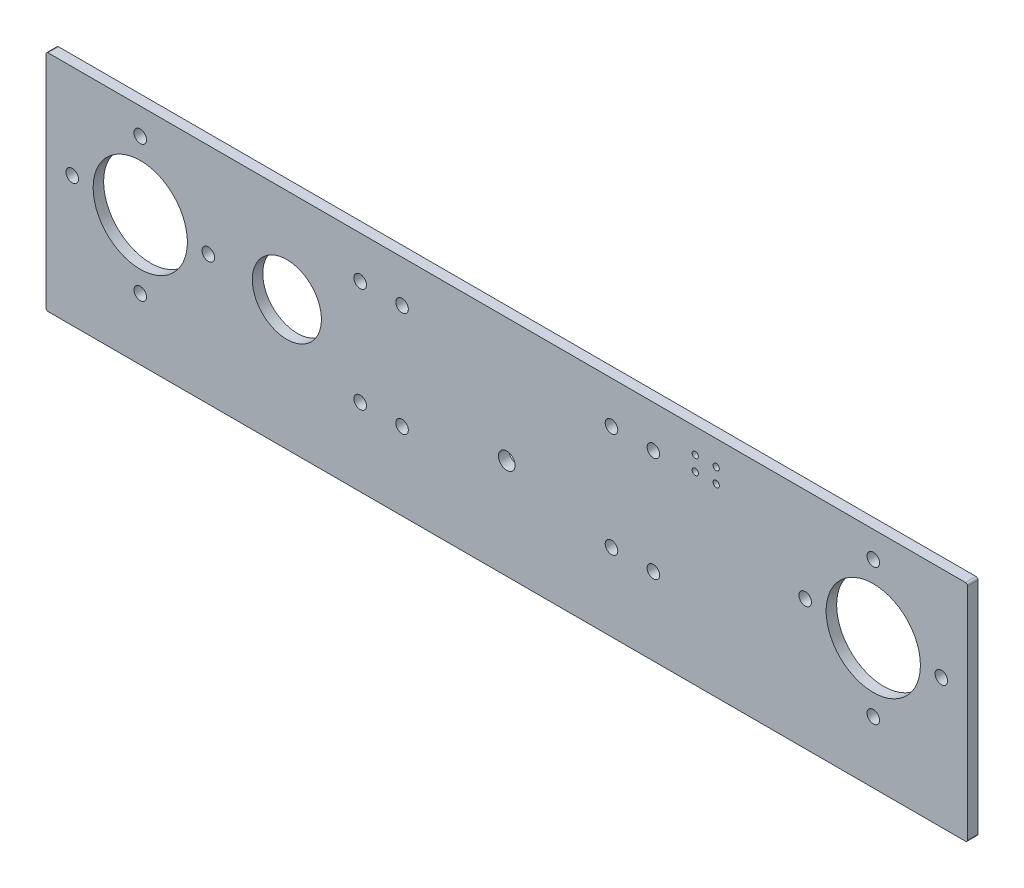
ISO-10303-21;
HEADER;
FILE_DESCRIPTION(('STEP AP214'),'2;1');
FILE_NAME('part.step','',(''),(''),'','','');
FILE_SCHEMA(('AUTOMOTIVE_DESIGN { 1 0 10303 214 1 1 1 1 }'));
ENDSEC;
DATA;
#1=APPLICATION_CONTEXT('core data for automotive mechanical design processes');
#2=APPLICATION_PROTOCOL_DEFINITION('international standard','automotive_design',2000,#1);
#3=PRODUCT_CONTEXT('',#1,'mechanical');
#4=PRODUCT('Part','Part','',(#3));
#5=PRODUCT_RELATED_PRODUCT_CATEGORY('part','',(#4));
#6=PRODUCT_DEFINITION_FORMATION('','',#4);
#7=PRODUCT_DEFINITION_CONTEXT('part definition',#1,'design');
#8=PRODUCT_DEFINITION('design','',#6,#7);
#9=PRODUCT_DEFINITION_SHAPE('','',#8);
#10=(LENGTH_UNIT() NAMED_UNIT(*) SI_UNIT(.MILLI.,.METRE.));
#11=(NAMED_UNIT(*) PLANE_ANGLE_UNIT() SI_UNIT($,.RADIAN.));
#12=(NAMED_UNIT(*) SI_UNIT($,.STERADIAN.) SOLID_ANGLE_UNIT());
#13=UNCERTAINTY_MEASURE_WITH_UNIT(LENGTH_MEASURE(1.E-05),#10,'distance_accuracy_value','');
#14=(GEOMETRIC_REPRESENTATION_CONTEXT(3) GLOBAL_UNCERTAINTY_ASSIGNED_CONTEXT((#13)) GLOBAL_UNIT_ASSIGNED_CONTEXT((#10,
#11,#12)) REPRESENTATION_CONTEXT('',''));
#15=CARTESIAN_POINT('',(0.,0.,0.));
#16=DIRECTION('',(0.,0.,1.));
#17=DIRECTION('',(1.,0.,0.));
#18=AXIS2_PLACEMENT_3D('',#15,#16,#17);
#19=CARTESIAN_POINT('',(220.,-53.5,-5.));
#20=DIRECTION('',(1.,0.,0.));
#21=DIRECTION('',(0.,0.,-1.));
#22=AXIS2_PLACEMENT_3D('',#19,#20,#21);
#23=PLANE('',#22);
#24=DIRECTION('',(0.,1.,0.));
#25=VECTOR('',#24,1.);
#26=CARTESIAN_POINT('',(220.,-53.5,0.));
#27=LINE('',#26,#25);
#28=CARTESIAN_POINT('',(220.,-52.5,0.));
#29=VERTEX_POINT('',#28);
#30=CARTESIAN_POINT('',(220.,52.5,0.));
#31=VERTEX_POINT('',#30);
#32=EDGE_CURVE('E277',#29,#31,#27,.T.);
#33=ORIENTED_EDGE('',*,*,#32,.F.);
#34=DIRECTION('',(0.,0.,1.));
#35=VECTOR('',#34,1.);
#36=CARTESIAN_POINT('',(220.,-52.5,-5.));
#37=LINE('',#36,#35);
#38=CARTESIAN_POINT('',(220.,-52.5,-5.));
#39=VERTEX_POINT('',#38);
#40=EDGE_CURVE('E11',#29,#39,#37,.F.);
#41=ORIENTED_EDGE('',*,*,#40,.T.);
#42=DIRECTION('',(0.,1.,0.));
#43=VECTOR('',#42,1.);
#44=CARTESIAN_POINT('',(220.,-53.5,-5.));
#45=LINE('',#44,#43);
#46=CARTESIAN_POINT('',(220.,52.5,-5.));
#47=VERTEX_POINT('',#46);
#48=EDGE_CURVE('E278',#39,#47,#45,.T.);
#49=ORIENTED_EDGE('',*,*,#48,.T.);
#50=DIRECTION('',(0.,0.,1.));
#51=VECTOR('',#50,1.);
#52=CARTESIAN_POINT('',(220.,52.5,-5.));
#53=LINE('',#52,#51);
#54=EDGE_CURVE('E49',#47,#31,#53,.T.);
#55=ORIENTED_EDGE('',*,*,#54,.T.);
#56=EDGE_LOOP('',(#33,#41,#49,#55));
#57=FACE_BOUND('',#56,.T.);
#58=ADVANCED_FACE('F40',(#57),#23,.T.);
#59=CARTESIAN_POINT('',(-220.,-53.5,-5.));
#60=DIRECTION('',(0.,-1.,0.));
#61=DIRECTION('',(0.,0.,-1.));
#62=AXIS2_PLACEMENT_3D('',#59,#60,#61);
#63=PLANE('',#62);
#64=DIRECTION('',(1.,0.,0.));
#65=VECTOR('',#64,1.);
#66=CARTESIAN_POINT('',(-220.,-53.5,0.));
#67=LINE('',#66,#65);
#68=CARTESIAN_POINT('',(-219.,-53.5,0.));
#69=VERTEX_POINT('',#68);
#70=CARTESIAN_POINT('',(219.,-53.5,0.));
#71=VERTEX_POINT('',#70);
#72=EDGE_CURVE('E127',#69,#71,#67,.T.);
#73=ORIENTED_EDGE('',*,*,#72,.F.);
#74=DIRECTION('',(0.,0.,1.));
#75=VECTOR('',#74,1.);
#76=CARTESIAN_POINT('',(-219.,-53.5,-5.));
#77=LINE('',#76,#75);
#78=CARTESIAN_POINT('',(-219.,-53.5,-5.));
#79=VERTEX_POINT('',#78);
#80=EDGE_CURVE('E147',#69,#79,#77,.F.);
#81=ORIENTED_EDGE('',*,*,#80,.T.);
#82=DIRECTION('',(1.,0.,0.));
#83=VECTOR('',#82,1.);
#84=CARTESIAN_POINT('',(-220.,-53.5,-5.));
#85=LINE('',#84,#83);
#86=CARTESIAN_POINT('',(219.,-53.5,-5.));
#87=VERTEX_POINT('',#86);
#88=EDGE_CURVE('E130',#79,#87,#85,.T.);
#89=ORIENTED_EDGE('',*,*,#88,.T.);
#90=DIRECTION('',(0.,0.,1.));
#91=VECTOR('',#90,1.);
#92=CARTESIAN_POINT('',(219.,-53.5,-5.));
#93=LINE('',#92,#91);
#94=EDGE_CURVE('E144',#87,#71,#93,.T.);
#95=ORIENTED_EDGE('',*,*,#94,.T.);
#96=EDGE_LOOP('',(#73,#81,#89,#95));
#97=FACE_BOUND('',#96,.T.);
#98=ADVANCED_FACE('F367',(#97),#63,.T.);
#99=CARTESIAN_POINT('',(-220.,-53.5,-5.));
#100=DIRECTION('',(-1.,0.,0.));
#101=DIRECTION('',(0.,0.,1.));
#102=AXIS2_PLACEMENT_3D('',#99,#100,#101);
#103=PLANE('',#102);
#104=DIRECTION('',(0.,-1.,0.));
#105=VECTOR('',#104,1.);
#106=CARTESIAN_POINT('',(-220.,-53.5,-5.));
#107=LINE('',#106,#105);
#108=CARTESIAN_POINT('',(-220.,52.5,-5.));
#109=VERTEX_POINT('',#108);
#110=CARTESIAN_POINT('',(-220.,-52.5,-5.));
#111=VERTEX_POINT('',#110);
#112=EDGE_CURVE('E135',#109,#111,#107,.T.);
#113=ORIENTED_EDGE('',*,*,#112,.T.);
#114=DIRECTION('',(0.,0.,1.));
#115=VECTOR('',#114,1.);
#116=CARTESIAN_POINT('',(-220.,-52.5,-5.));
#117=LINE('',#116,#115);
#118=CARTESIAN_POINT('',(-220.,-52.5,0.));
#119=VERTEX_POINT('',#118);
#120=EDGE_CURVE('E126',#111,#119,#117,.T.);
#121=ORIENTED_EDGE('',*,*,#120,.T.);
#122=DIRECTION('',(0.,-1.,0.));
#123=VECTOR('',#122,1.);
#124=CARTESIAN_POINT('',(-220.,-53.5,0.));
#125=LINE('',#124,#123);
#126=CARTESIAN_POINT('',(-220.,52.5,0.));
#127=VERTEX_POINT('',#126);
#128=EDGE_CURVE('E111',#127,#119,#125,.T.);
#129=ORIENTED_EDGE('',*,*,#128,.F.);
#130=DIRECTION('',(0.,0.,1.));
#131=VECTOR('',#130,1.);
#132=CARTESIAN_POINT('',(-220.,52.5,-5.));
#133=LINE('',#132,#131);
#134=EDGE_CURVE('E124',#127,#109,#133,.F.);
#135=ORIENTED_EDGE('',*,*,#134,.T.);
#136=EDGE_LOOP('',(#113,#121,#129,#135));
#137=FACE_BOUND('',#136,.T.);
#138=ADVANCED_FACE('F123',(#137),#103,.T.);
#139=CARTESIAN_POINT('',(-220.,53.5,-5.));
#140=DIRECTION('',(0.,1.,0.));
#141=DIRECTION('',(0.,0.,1.));
#142=AXIS2_PLACEMENT_3D('',#139,#140,#141);
#143=PLANE('',#142);
#144=DIRECTION('',(-1.,0.,0.));
#145=VECTOR('',#144,1.);
#146=CARTESIAN_POINT('',(-220.,53.5,-5.));
#147=LINE('',#146,#145);
#148=CARTESIAN_POINT('',(219.,53.5,-5.));
#149=VERTEX_POINT('',#148);
#150=CARTESIAN_POINT('',(-219.,53.5,-5.));
#151=VERTEX_POINT('',#150);
#152=EDGE_CURVE('E281',#149,#151,#147,.T.);
#153=ORIENTED_EDGE('',*,*,#152,.T.);
#154=DIRECTION('',(0.,0.,1.));
#155=VECTOR('',#154,1.);
#156=CARTESIAN_POINT('',(-219.,53.5,-5.));
#157=LINE('',#156,#155);
#158=CARTESIAN_POINT('',(-219.,53.5,0.));
#159=VERTEX_POINT('',#158);
#160=EDGE_CURVE('E157',#151,#159,#157,.T.);
#161=ORIENTED_EDGE('',*,*,#160,.T.);
#162=DIRECTION('',(-1.,0.,0.));
#163=VECTOR('',#162,1.);
#164=CARTESIAN_POINT('',(-220.,53.5,0.));
#165=LINE('',#164,#163);
#166=CARTESIAN_POINT('',(219.,53.5,0.));
#167=VERTEX_POINT('',#166);
#168=EDGE_CURVE('E112',#167,#159,#165,.T.);
#169=ORIENTED_EDGE('',*,*,#168,.F.);
#170=DIRECTION('',(0.,0.,1.));
#171=VECTOR('',#170,1.);
#172=CARTESIAN_POINT('',(219.,53.5,-5.));
#173=LINE('',#172,#171);
#174=EDGE_CURVE('E64',#167,#149,#173,.F.);
#175=ORIENTED_EDGE('',*,*,#174,.T.);
#176=EDGE_LOOP('',(#153,#161,#169,#175));
#177=FACE_BOUND('',#176,.T.);
#178=ADVANCED_FACE('F379',(#177),#143,.T.);
#179=CARTESIAN_POINT('',(0.,0.,-5.));
#180=DIRECTION('',(0.,0.,-1.));
#181=DIRECTION('',(-1.,0.,0.));
#182=AXIS2_PLACEMENT_3D('',#179,#180,#181);
#183=PLANE('',#182);
#184=CARTESIAN_POINT('',(100.,34.75,-5.));
#185=DIRECTION('',(0.,0.,-1.));
#186=DIRECTION('',(-1.,0.,0.));
#187=AXIS2_PLACEMENT_3D('',#184,#185,#186);
#188=CIRCLE('',#187,1.50000000000001);
#189=CARTESIAN_POINT('',(98.5,34.75,-5.));
#190=VERTEX_POINT('',#189);
#191=EDGE_CURVE('E752',#190,#190,#188,.T.);
#192=ORIENTED_EDGE('',*,*,#191,.F.);
#193=EDGE_LOOP('',(#192));
#194=FACE_BOUND('',#193,.T.);
#195=CARTESIAN_POINT('',(90.0000000000001,34.75,-5.));
#196=DIRECTION('',(0.,0.,-1.));
#197=DIRECTION('',(-1.,0.,0.));
#198=AXIS2_PLACEMENT_3D('',#195,#196,#197);
#199=CIRCLE('',#198,1.5);
#200=CARTESIAN_POINT('',(88.5000000000001,34.75,-5.));
#201=VERTEX_POINT('',#200);
#202=EDGE_CURVE('E753',#201,#201,#199,.T.);
#203=ORIENTED_EDGE('',*,*,#202,.F.);
#204=EDGE_LOOP('',(#203));
#205=FACE_BOUND('',#204,.T.);
#206=CARTESIAN_POINT('',(90.0000000000001,41.75,-5.));
#207=DIRECTION('',(0.,0.,-1.));
#208=DIRECTION('',(-1.,0.,0.));
#209=AXIS2_PLACEMENT_3D('',#206,#207,#208);
#210=CIRCLE('',#209,1.5);
#211=CARTESIAN_POINT('',(88.5000000000001,41.75,-5.));
#212=VERTEX_POINT('',#211);
#213=EDGE_CURVE('E756',#212,#212,#210,.T.);
#214=ORIENTED_EDGE('',*,*,#213,.F.);
#215=EDGE_LOOP('',(#214));
#216=FACE_BOUND('',#215,.T.);
#217=CARTESIAN_POINT('',(100.,41.75,-5.));
#218=DIRECTION('',(0.,0.,-1.));
#219=DIRECTION('',(-1.,0.,0.));
#220=AXIS2_PLACEMENT_3D('',#217,#218,#219);
#221=CIRCLE('',#220,1.50000000000001);
#222=CARTESIAN_POINT('',(98.5,41.75,-5.));
#223=VERTEX_POINT('',#222);
#224=EDGE_CURVE('E165',#223,#223,#221,.T.);
#225=ORIENTED_EDGE('',*,*,#224,.F.);
#226=EDGE_LOOP('',(#225));
#227=FACE_BOUND('',#226,.T.);
#228=CARTESIAN_POINT('',(70.,-16.5,-5.));
#229=DIRECTION('',(0.,0.,1.));
#230=DIRECTION('',(-1.,0.,0.));
#231=AXIS2_PLACEMENT_3D('',#228,#229,#230);
#232=CIRCLE('',#231,3.00000000000001);
#233=CARTESIAN_POINT('',(67.,-16.5,-5.));
#234=VERTEX_POINT('',#233);
#235=EDGE_CURVE('E176',#234,#234,#232,.T.);
#236=ORIENTED_EDGE('',*,*,#235,.T.);
#237=EDGE_LOOP('',(#236));
#238=FACE_BOUND('',#237,.T.);
#239=CARTESIAN_POINT('',(50.,-16.5,-5.));
#240=DIRECTION('',(0.,0.,1.));
#241=DIRECTION('',(-1.,0.,0.));
#242=AXIS2_PLACEMENT_3D('',#239,#240,#241);
#243=CIRCLE('',#242,3.00000000000001);
#244=CARTESIAN_POINT('',(47.,-16.5,-5.));
#245=VERTEX_POINT('',#244);
#246=EDGE_CURVE('E172',#245,#245,#243,.T.);
#247=ORIENTED_EDGE('',*,*,#246,.T.);
#248=EDGE_LOOP('',(#247));
#249=FACE_BOUND('',#248,.T.);
#250=CARTESIAN_POINT('',(-70.,-16.5,-5.));
#251=DIRECTION('',(0.,0.,-1.));
#252=DIRECTION('',(1.,0.,0.));
#253=AXIS2_PLACEMENT_3D('',#250,#251,#252);
#254=CIRCLE('',#253,3.00000000000001);
#255=CARTESIAN_POINT('',(-67.,-16.5,-5.));
#256=VERTEX_POINT('',#255);
#257=EDGE_CURVE('E185',#256,#256,#254,.T.);
#258=ORIENTED_EDGE('',*,*,#257,.F.);
#259=EDGE_LOOP('',(#258));
#260=FACE_BOUND('',#259,.T.);
#261=CARTESIAN_POINT('',(-50.,-16.5,-5.));
#262=DIRECTION('',(0.,0.,-1.));
#263=DIRECTION('',(1.,0.,0.));
#264=AXIS2_PLACEMENT_3D('',#261,#262,#263);
#265=CIRCLE('',#264,3.00000000000001);
#266=CARTESIAN_POINT('',(-47.,-16.5,-5.));
#267=VERTEX_POINT('',#266);
#268=EDGE_CURVE('E189',#267,#267,#265,.T.);
#269=ORIENTED_EDGE('',*,*,#268,.F.);
#270=EDGE_LOOP('',(#269));
#271=FACE_BOUND('',#270,.T.);
#272=CARTESIAN_POINT('',(-70.,33.5,-5.));
#273=DIRECTION('',(0.,0.,1.));
#274=DIRECTION('',(1.,0.,0.));
#275=AXIS2_PLACEMENT_3D('',#272,#273,#274);
#276=CIRCLE('',#275,3.00000000000001);
#277=CARTESIAN_POINT('',(-67.,33.5,-5.));
#278=VERTEX_POINT('',#277);
#279=EDGE_CURVE('E192',#278,#278,#276,.T.);
#280=ORIENTED_EDGE('',*,*,#279,.T.);
#281=EDGE_LOOP('',(#280));
#282=FACE_BOUND('',#281,.T.);
#283=CARTESIAN_POINT('',(-50.,33.5,-5.));
#284=DIRECTION('',(0.,0.,1.));
#285=DIRECTION('',(1.,0.,0.));
#286=AXIS2_PLACEMENT_3D('',#283,#284,#285);
#287=CIRCLE('',#286,3.00000000000001);
#288=CARTESIAN_POINT('',(-47.,33.5,-5.));
#289=VERTEX_POINT('',#288);
#290=EDGE_CURVE('E196',#289,#289,#287,.T.);
#291=ORIENTED_EDGE('',*,*,#290,.T.);
#292=EDGE_LOOP('',(#291));
#293=FACE_BOUND('',#292,.T.);
#294=CARTESIAN_POINT('',(70.,33.5,-5.));
#295=DIRECTION('',(0.,0.,-1.));
#296=DIRECTION('',(-1.,0.,0.));
#297=AXIS2_PLACEMENT_3D('',#294,#295,#296);
#298=CIRCLE('',#297,3.00000000000001);
#299=CARTESIAN_POINT('',(67.,33.5,-5.));
#300=VERTEX_POINT('',#299);
#301=EDGE_CURVE('E200',#300,#300,#298,.T.);
#302=ORIENTED_EDGE('',*,*,#301,.F.);
#303=EDGE_LOOP('',(#302));
#304=FACE_BOUND('',#303,.T.);
#305=CARTESIAN_POINT('',(50.,33.5,-5.));
#306=DIRECTION('',(0.,0.,-1.));
#307=DIRECTION('',(-1.,0.,0.));
#308=AXIS2_PLACEMENT_3D('',#305,#306,#307);
#309=CIRCLE('',#308,3.00000000000001);
#310=CARTESIAN_POINT('',(47.,33.5,-5.));
#311=VERTEX_POINT('',#310);
#312=EDGE_CURVE('E204',#311,#311,#309,.T.);
#313=ORIENTED_EDGE('',*,*,#312,.F.);
#314=EDGE_LOOP('',(#313));
#315=FACE_BOUND('',#314,.T.);
#316=CARTESIAN_POINT('',(0.,-5.63050654164931,-5.));
#317=DIRECTION('',(0.,0.,-1.));
#318=DIRECTION('',(-1.,0.,0.));
#319=AXIS2_PLACEMENT_3D('',#316,#317,#318);
#320=CIRCLE('',#319,4.);
#321=CARTESIAN_POINT('',(-4.,-5.63050654164931,-5.));
#322=VERTEX_POINT('',#321);
#323=EDGE_CURVE('E208',#322,#322,#320,.T.);
#324=ORIENTED_EDGE('',*,*,#323,.F.);
#325=EDGE_LOOP('',(#324));
#326=FACE_BOUND('',#325,.T.);
#327=CARTESIAN_POINT('',(-105.,8.50000000000001,-5.));
#328=DIRECTION('',(0.,0.,-1.));
#329=DIRECTION('',(-1.,0.,0.));
#330=AXIS2_PLACEMENT_3D('',#327,#328,#329);
#331=CIRCLE('',#330,16.5);
#332=CARTESIAN_POINT('',(-121.5,8.50000000000001,-5.));
#333=VERTEX_POINT('',#332);
#334=EDGE_CURVE('E213',#333,#333,#331,.T.);
#335=ORIENTED_EDGE('',*,*,#334,.F.);
#336=EDGE_LOOP('',(#335));
#337=FACE_BOUND('',#336,.T.);
#338=CARTESIAN_POINT('',(-175.,41.,-5.));
#339=DIRECTION('',(0.,0.,-1.));
#340=DIRECTION('',(-1.,0.,0.));
#341=AXIS2_PLACEMENT_3D('',#338,#339,#340);
#342=CIRCLE('',#341,2.99999999999999);
#343=CARTESIAN_POINT('',(-178.,41.,-5.));
#344=VERTEX_POINT('',#343);
#345=EDGE_CURVE('E238',#344,#344,#342,.F.);
#346=ORIENTED_EDGE('',*,*,#345,.T.);
#347=EDGE_LOOP('',(#346));
#348=FACE_BOUND('',#347,.T.);
#349=CARTESIAN_POINT('',(-207.5,8.5,-5.));
#350=DIRECTION('',(0.,0.,-1.));
#351=DIRECTION('',(-1.,0.,0.));
#352=AXIS2_PLACEMENT_3D('',#349,#350,#351);
#353=CIRCLE('',#352,2.99999999999997);
#354=CARTESIAN_POINT('',(-210.5,8.5,-5.));
#355=VERTEX_POINT('',#354);
#356=EDGE_CURVE('E235',#355,#355,#353,.F.);
#357=ORIENTED_EDGE('',*,*,#356,.T.);
#358=EDGE_LOOP('',(#357));
#359=FACE_BOUND('',#358,.T.);
#360=CARTESIAN_POINT('',(-175.,-24.,-5.));
#361=DIRECTION('',(0.,0.,-1.));
#362=DIRECTION('',(-1.,0.,0.));
#363=AXIS2_PLACEMENT_3D('',#360,#361,#362);
#364=CIRCLE('',#363,2.99999999999999);
#365=CARTESIAN_POINT('',(-178.,-24.,-5.));
#366=VERTEX_POINT('',#365);
#367=EDGE_CURVE('E232',#366,#366,#364,.F.);
#368=ORIENTED_EDGE('',*,*,#367,.T.);
#369=EDGE_LOOP('',(#368));
#370=FACE_BOUND('',#369,.T.);
#371=CARTESIAN_POINT('',(-142.5,8.50000000000001,-5.));
#372=DIRECTION('',(0.,0.,-1.));
#373=DIRECTION('',(-1.,0.,0.));
#374=AXIS2_PLACEMENT_3D('',#371,#372,#373);
#375=CIRCLE('',#374,2.99999999999999);
#376=CARTESIAN_POINT('',(-145.5,8.50000000000001,-5.));
#377=VERTEX_POINT('',#376);
#378=EDGE_CURVE('E220',#377,#377,#375,.F.);
#379=ORIENTED_EDGE('',*,*,#378,.T.);
#380=EDGE_LOOP('',(#379));
#381=FACE_BOUND('',#380,.T.);
#382=CARTESIAN_POINT('',(-175.,8.50000000000001,-5.));
#383=DIRECTION('',(0.,0.,-1.));
#384=DIRECTION('',(-1.,0.,0.));
#385=AXIS2_PLACEMENT_3D('',#382,#383,#384);
#386=CIRCLE('',#385,22.5);
#387=CARTESIAN_POINT('',(-197.5,8.50000000000001,-5.));
#388=VERTEX_POINT('',#387);
#389=EDGE_CURVE('E244',#388,#388,#386,.F.);
#390=ORIENTED_EDGE('',*,*,#389,.T.);
#391=EDGE_LOOP('',(#390));
#392=FACE_BOUND('',#391,.T.);
#393=CARTESIAN_POINT('',(175.,41.,-5.));
#394=DIRECTION('',(0.,0.,-1.));
#395=DIRECTION('',(-1.,0.,0.));
#396=AXIS2_PLACEMENT_3D('',#393,#394,#395);
#397=CIRCLE('',#396,2.99999999999999);
#398=CARTESIAN_POINT('',(172.,41.,-5.));
#399=VERTEX_POINT('',#398);
#400=EDGE_CURVE('E268',#399,#399,#397,.T.);
#401=ORIENTED_EDGE('',*,*,#400,.F.);
#402=EDGE_LOOP('',(#401));
#403=FACE_BOUND('',#402,.T.);
#404=CARTESIAN_POINT('',(207.5,8.5,-5.));
#405=DIRECTION('',(0.,0.,-1.));
#406=DIRECTION('',(-1.,0.,0.));
#407=AXIS2_PLACEMENT_3D('',#404,#405,#406);
#408=CIRCLE('',#407,2.99999999999997);
#409=CARTESIAN_POINT('',(204.5,8.5,-5.));
#410=VERTEX_POINT('',#409);
#411=EDGE_CURVE('E265',#410,#410,#408,.T.);
#412=ORIENTED_EDGE('',*,*,#411,.F.);
#413=EDGE_LOOP('',(#412));
#414=FACE_BOUND('',#413,.T.);
#415=CARTESIAN_POINT('',(175.,-24.,-5.));
#416=DIRECTION('',(0.,0.,-1.));
#417=DIRECTION('',(-1.,0.,0.));
#418=AXIS2_PLACEMENT_3D('',#415,#416,#417);
#419=CIRCLE('',#418,2.99999999999999);
#420=CARTESIAN_POINT('',(172.,-24.,-5.));
#421=VERTEX_POINT('',#420);
#422=EDGE_CURVE('E262',#421,#421,#419,.T.);
#423=ORIENTED_EDGE('',*,*,#422,.F.);
#424=EDGE_LOOP('',(#423));
#425=FACE_BOUND('',#424,.T.);
#426=CARTESIAN_POINT('',(142.5,8.50000000000001,-5.));
#427=DIRECTION('',(0.,0.,-1.));
#428=DIRECTION('',(-1.,0.,0.));
#429=AXIS2_PLACEMENT_3D('',#426,#427,#428);
#430=CIRCLE('',#429,2.99999999999999);
#431=CARTESIAN_POINT('',(139.5,8.50000000000001,-5.));
#432=VERTEX_POINT('',#431);
#433=EDGE_CURVE('E251',#432,#432,#430,.T.);
#434=ORIENTED_EDGE('',*,*,#433,.F.);
#435=EDGE_LOOP('',(#434));
#436=FACE_BOUND('',#435,.T.);
#437=CARTESIAN_POINT('',(175.,8.50000000000001,-5.));
#438=DIRECTION('',(0.,0.,-1.));
#439=DIRECTION('',(-1.,0.,0.));
#440=AXIS2_PLACEMENT_3D('',#437,#438,#439);
#441=CIRCLE('',#440,22.5);
#442=CARTESIAN_POINT('',(152.5,8.50000000000001,-5.));
#443=VERTEX_POINT('',#442);
#444=EDGE_CURVE('E274',#443,#443,#441,.T.);
#445=ORIENTED_EDGE('',*,*,#444,.F.);
#446=EDGE_LOOP('',(#445));
#447=FACE_BOUND('',#446,.T.);
#448=ORIENTED_EDGE('',*,*,#88,.F.);
#449=CARTESIAN_POINT('',(-219.,-52.5,-5.));
#450=DIRECTION('',(0.,0.,-1.));
#451=DIRECTION('',(-1.,0.,0.));
#452=AXIS2_PLACEMENT_3D('',#449,#450,#451);
#453=CIRCLE('',#452,1.);
#454=EDGE_CURVE('E154',#79,#111,#453,.T.);
#455=ORIENTED_EDGE('',*,*,#454,.T.);
#456=ORIENTED_EDGE('',*,*,#112,.F.);
#457=CARTESIAN_POINT('',(-219.,52.5,-5.));
#458=DIRECTION('',(0.,0.,-1.));
#459=DIRECTION('',(-1.,0.,0.));
#460=AXIS2_PLACEMENT_3D('',#457,#458,#459);
#461=CIRCLE('',#460,1.);
#462=EDGE_CURVE('E57',#109,#151,#461,.T.);
#463=ORIENTED_EDGE('',*,*,#462,.T.);
#464=ORIENTED_EDGE('',*,*,#152,.F.);
#465=CARTESIAN_POINT('',(219.,52.5,-5.));
#466=DIRECTION('',(0.,0.,-1.));
#467=DIRECTION('',(-1.,0.,0.));
#468=AXIS2_PLACEMENT_3D('',#465,#466,#467);
#469=CIRCLE('',#468,1.);
#470=EDGE_CURVE('E149',#149,#47,#469,.T.);
#471=ORIENTED_EDGE('',*,*,#470,.T.);
#472=ORIENTED_EDGE('',*,*,#48,.F.);
#473=CARTESIAN_POINT('',(219.,-52.5,-5.));
#474=DIRECTION('',(0.,0.,-1.));
#475=DIRECTION('',(-1.,0.,0.));
#476=AXIS2_PLACEMENT_3D('',#473,#474,#475);
#477=CIRCLE('',#476,1.);
#478=EDGE_CURVE('E151',#39,#87,#477,.T.);
#479=ORIENTED_EDGE('',*,*,#478,.T.);
#480=EDGE_LOOP('',(#448,#455,#456,#463,#464,#471,#472,#479));
#481=FACE_BOUND('',#480,.T.);
#482=ADVANCED_FACE('F315',(#194,#205,#216,#227,#238,#249,#260,#271,#282,#293,#304,#315,#326,
#337,#348,#359,#370,#381,#392,#403,#414,#425,#436,#447,#481),#183,.T.);
#483=CARTESIAN_POINT('',(0.,0.,0.));
#484=DIRECTION('',(0.,0.,-1.));
#485=DIRECTION('',(-1.,0.,0.));
#486=AXIS2_PLACEMENT_3D('',#483,#484,#485);
#487=PLANE('',#486);
#488=CARTESIAN_POINT('',(100.,34.75,0.));
#489=DIRECTION('',(0.,0.,-1.));
#490=DIRECTION('',(-1.,0.,0.));
#491=AXIS2_PLACEMENT_3D('',#488,#489,#490);
#492=CIRCLE('',#491,1.50000000000001);
#493=CARTESIAN_POINT('',(98.5,34.75,0.));
#494=VERTEX_POINT('',#493);
#495=EDGE_CURVE('E44',#494,#494,#492,.T.);
#496=ORIENTED_EDGE('',*,*,#495,.T.);
#497=EDGE_LOOP('',(#496));
#498=FACE_BOUND('',#497,.T.);
#499=CARTESIAN_POINT('',(90.0000000000001,34.75,0.));
#500=DIRECTION('',(0.,0.,-1.));
#501=DIRECTION('',(-1.,0.,0.));
#502=AXIS2_PLACEMENT_3D('',#499,#500,#501);
#503=CIRCLE('',#502,1.5);
#504=CARTESIAN_POINT('',(88.5000000000001,34.75,0.));
#505=VERTEX_POINT('',#504);
#506=EDGE_CURVE('E167',#505,#505,#503,.T.);
#507=ORIENTED_EDGE('',*,*,#506,.T.);
#508=EDGE_LOOP('',(#507));
#509=FACE_BOUND('',#508,.T.);
#510=CARTESIAN_POINT('',(90.0000000000001,41.75,0.));
#511=DIRECTION('',(0.,0.,-1.));
#512=DIRECTION('',(-1.,0.,0.));
#513=AXIS2_PLACEMENT_3D('',#510,#511,#512);
#514=CIRCLE('',#513,1.5);
#515=CARTESIAN_POINT('',(88.5000000000001,41.75,0.));
#516=VERTEX_POINT('',#515);
#517=EDGE_CURVE('E164',#516,#516,#514,.T.);
#518=ORIENTED_EDGE('',*,*,#517,.T.);
#519=EDGE_LOOP('',(#518));
#520=FACE_BOUND('',#519,.T.);
#521=CARTESIAN_POINT('',(100.,41.75,0.));
#522=DIRECTION('',(0.,0.,-1.));
#523=DIRECTION('',(-1.,0.,0.));
#524=AXIS2_PLACEMENT_3D('',#521,#522,#523);
#525=CIRCLE('',#524,1.50000000000001);
#526=CARTESIAN_POINT('',(98.5,41.75,0.));
#527=VERTEX_POINT('',#526);
#528=EDGE_CURVE('E161',#527,#527,#525,.T.);
#529=ORIENTED_EDGE('',*,*,#528,.T.);
#530=EDGE_LOOP('',(#529));
#531=FACE_BOUND('',#530,.T.);
#532=CARTESIAN_POINT('',(70.,-16.5,0.));
#533=DIRECTION('',(0.,0.,-1.));
#534=DIRECTION('',(-1.,0.,0.));
#535=AXIS2_PLACEMENT_3D('',#532,#533,#534);
#536=CIRCLE('',#535,3.00000000000001);
#537=CARTESIAN_POINT('',(67.,-16.5,0.));
#538=VERTEX_POINT('',#537);
#539=EDGE_CURVE('E138',#538,#538,#536,.F.);
#540=ORIENTED_EDGE('',*,*,#539,.F.);
#541=EDGE_LOOP('',(#540));
#542=FACE_BOUND('',#541,.T.);
#543=CARTESIAN_POINT('',(50.,-16.5,0.));
#544=DIRECTION('',(0.,0.,-1.));
#545=DIRECTION('',(-1.,0.,0.));
#546=AXIS2_PLACEMENT_3D('',#543,#544,#545);
#547=CIRCLE('',#546,3.00000000000001);
#548=CARTESIAN_POINT('',(47.,-16.5,0.));
#549=VERTEX_POINT('',#548);
#550=EDGE_CURVE('E181',#549,#549,#547,.F.);
#551=ORIENTED_EDGE('',*,*,#550,.F.);
#552=EDGE_LOOP('',(#551));
#553=FACE_BOUND('',#552,.T.);
#554=CARTESIAN_POINT('',(-70.,-16.5,0.));
#555=DIRECTION('',(0.,0.,-1.));
#556=DIRECTION('',(-1.,0.,0.));
#557=AXIS2_PLACEMENT_3D('',#554,#555,#556);
#558=CIRCLE('',#557,3.00000000000001);
#559=CARTESIAN_POINT('',(-73.,-16.5,0.));
#560=VERTEX_POINT('',#559);
#561=EDGE_CURVE('E199',#560,#560,#558,.T.);
#562=ORIENTED_EDGE('',*,*,#561,.T.);
#563=EDGE_LOOP('',(#562));
#564=FACE_BOUND('',#563,.T.);
#565=CARTESIAN_POINT('',(-50.,-16.5,0.));
#566=DIRECTION('',(0.,0.,-1.));
#567=DIRECTION('',(-1.,0.,0.));
#568=AXIS2_PLACEMENT_3D('',#565,#566,#567);
#569=CIRCLE('',#568,3.00000000000001);
#570=CARTESIAN_POINT('',(-53.,-16.5,0.));
#571=VERTEX_POINT('',#570);
#572=EDGE_CURVE('E188',#571,#571,#569,.T.);
#573=ORIENTED_EDGE('',*,*,#572,.T.);
#574=EDGE_LOOP('',(#573));
#575=FACE_BOUND('',#574,.T.);
#576=CARTESIAN_POINT('',(-70.,33.5,0.));
#577=DIRECTION('',(0.,0.,-1.));
#578=DIRECTION('',(-1.,0.,0.));
#579=AXIS2_PLACEMENT_3D('',#576,#577,#578);
#580=CIRCLE('',#579,3.00000000000001);
#581=CARTESIAN_POINT('',(-73.,33.5,0.));
#582=VERTEX_POINT('',#581);
#583=EDGE_CURVE('E207',#582,#582,#580,.F.);
#584=ORIENTED_EDGE('',*,*,#583,.F.);
#585=EDGE_LOOP('',(#584));
#586=FACE_BOUND('',#585,.T.);
#587=CARTESIAN_POINT('',(-50.,33.5,0.));
#588=DIRECTION('',(0.,0.,-1.));
#589=DIRECTION('',(-1.,0.,0.));
#590=AXIS2_PLACEMENT_3D('',#587,#588,#589);
#591=CIRCLE('',#590,3.00000000000001);
#592=CARTESIAN_POINT('',(-53.,33.5,0.));
#593=VERTEX_POINT('',#592);
#594=EDGE_CURVE('E195',#593,#593,#591,.F.);
#595=ORIENTED_EDGE('',*,*,#594,.F.);
#596=EDGE_LOOP('',(#595));
#597=FACE_BOUND('',#596,.T.);
#598=CARTESIAN_POINT('',(70.,33.5,0.));
#599=DIRECTION('',(0.,0.,-1.));
#600=DIRECTION('',(-1.,0.,0.));
#601=AXIS2_PLACEMENT_3D('',#598,#599,#600);
#602=CIRCLE('',#601,3.00000000000001);
#603=CARTESIAN_POINT('',(67.,33.5,0.));
#604=VERTEX_POINT('',#603);
#605=EDGE_CURVE('E212',#604,#604,#602,.T.);
#606=ORIENTED_EDGE('',*,*,#605,.T.);
#607=EDGE_LOOP('',(#606));
#608=FACE_BOUND('',#607,.T.);
#609=CARTESIAN_POINT('',(50.,33.5,0.));
#610=DIRECTION('',(0.,0.,-1.));
#611=DIRECTION('',(-1.,0.,0.));
#612=AXIS2_PLACEMENT_3D('',#609,#610,#611);
#613=CIRCLE('',#612,3.00000000000001);
#614=CARTESIAN_POINT('',(47.,33.5,0.));
#615=VERTEX_POINT('',#614);
#616=EDGE_CURVE('E203',#615,#615,#613,.T.);
#617=ORIENTED_EDGE('',*,*,#616,.T.);
#618=EDGE_LOOP('',(#617));
#619=FACE_BOUND('',#618,.T.);
#620=CARTESIAN_POINT('',(0.,-5.63050654164931,0.));
#621=DIRECTION('',(0.,0.,-1.));
#622=DIRECTION('',(-1.,0.,0.));
#623=AXIS2_PLACEMENT_3D('',#620,#621,#622);
#624=CIRCLE('',#623,4.);
#625=CARTESIAN_POINT('',(-4.,-5.63050654164931,0.));
#626=VERTEX_POINT('',#625);
#627=EDGE_CURVE('E211',#626,#626,#624,.T.);
#628=ORIENTED_EDGE('',*,*,#627,.T.);
#629=EDGE_LOOP('',(#628));
#630=FACE_BOUND('',#629,.T.);
#631=CARTESIAN_POINT('',(-105.,8.50000000000001,0.));
#632=DIRECTION('',(0.,0.,-1.));
#633=DIRECTION('',(-1.,0.,0.));
#634=AXIS2_PLACEMENT_3D('',#631,#632,#633);
#635=CIRCLE('',#634,16.5);
#636=CARTESIAN_POINT('',(-121.5,8.50000000000001,0.));
#637=VERTEX_POINT('',#636);
#638=EDGE_CURVE('E216',#637,#637,#635,.T.);
#639=ORIENTED_EDGE('',*,*,#638,.T.);
#640=EDGE_LOOP('',(#639));
#641=FACE_BOUND('',#640,.T.);
#642=CARTESIAN_POINT('',(-175.,41.,0.));
#643=DIRECTION('',(0.,0.,-1.));
#644=DIRECTION('',(-1.,0.,0.));
#645=AXIS2_PLACEMENT_3D('',#642,#643,#644);
#646=CIRCLE('',#645,2.99999999999999);
#647=CARTESIAN_POINT('',(-178.,41.,0.));
#648=VERTEX_POINT('',#647);
#649=EDGE_CURVE('E217',#648,#648,#646,.T.);
#650=ORIENTED_EDGE('',*,*,#649,.T.);
#651=EDGE_LOOP('',(#650));
#652=FACE_BOUND('',#651,.T.);
#653=CARTESIAN_POINT('',(-207.5,8.5,0.));
#654=DIRECTION('',(0.,0.,-1.));
#655=DIRECTION('',(-1.,0.,0.));
#656=AXIS2_PLACEMENT_3D('',#653,#654,#655);
#657=CIRCLE('',#656,2.99999999999997);
#658=CARTESIAN_POINT('',(-210.5,8.5,0.));
#659=VERTEX_POINT('',#658);
#660=EDGE_CURVE('E221',#659,#659,#657,.T.);
#661=ORIENTED_EDGE('',*,*,#660,.T.);
#662=EDGE_LOOP('',(#661));
#663=FACE_BOUND('',#662,.T.);
#664=CARTESIAN_POINT('',(-175.,-24.,0.));
#665=DIRECTION('',(0.,0.,-1.));
#666=DIRECTION('',(-1.,0.,0.));
#667=AXIS2_PLACEMENT_3D('',#664,#665,#666);
#668=CIRCLE('',#667,2.99999999999999);
#669=CARTESIAN_POINT('',(-178.,-24.,0.));
#670=VERTEX_POINT('',#669);
#671=EDGE_CURVE('E224',#670,#670,#668,.T.);
#672=ORIENTED_EDGE('',*,*,#671,.T.);
#673=EDGE_LOOP('',(#672));
#674=FACE_BOUND('',#673,.T.);
#675=CARTESIAN_POINT('',(-142.5,8.50000000000001,0.));
#676=DIRECTION('',(0.,0.,-1.));
#677=DIRECTION('',(-1.,0.,0.));
#678=AXIS2_PLACEMENT_3D('',#675,#676,#677);
#679=CIRCLE('',#678,2.99999999999999);
#680=CARTESIAN_POINT('',(-145.5,8.50000000000001,0.));
#681=VERTEX_POINT('',#680);
#682=EDGE_CURVE('E227',#681,#681,#679,.T.);
#683=ORIENTED_EDGE('',*,*,#682,.T.);
#684=EDGE_LOOP('',(#683));
#685=FACE_BOUND('',#684,.T.);
#686=CARTESIAN_POINT('',(-175.,8.50000000000001,0.));
#687=DIRECTION('',(0.,0.,-1.));
#688=DIRECTION('',(-1.,0.,0.));
#689=AXIS2_PLACEMENT_3D('',#686,#687,#688);
#690=CIRCLE('',#689,22.5);
#691=CARTESIAN_POINT('',(-197.5,8.50000000000001,0.));
#692=VERTEX_POINT('',#691);
#693=EDGE_CURVE('E241',#692,#692,#690,.T.);
#694=ORIENTED_EDGE('',*,*,#693,.T.);
#695=EDGE_LOOP('',(#694));
#696=FACE_BOUND('',#695,.T.);
#697=CARTESIAN_POINT('',(175.,41.,0.));
#698=DIRECTION('',(0.,0.,1.));
#699=DIRECTION('',(1.,0.,0.));
#700=AXIS2_PLACEMENT_3D('',#697,#698,#699);
#701=CIRCLE('',#700,2.99999999999999);
#702=CARTESIAN_POINT('',(178.,41.,0.));
#703=VERTEX_POINT('',#702);
#704=EDGE_CURVE('E248',#703,#703,#701,.T.);
#705=ORIENTED_EDGE('',*,*,#704,.F.);
#706=EDGE_LOOP('',(#705));
#707=FACE_BOUND('',#706,.T.);
#708=CARTESIAN_POINT('',(207.5,8.5,0.));
#709=DIRECTION('',(0.,0.,1.));
#710=DIRECTION('',(1.,0.,0.));
#711=AXIS2_PLACEMENT_3D('',#708,#709,#710);
#712=CIRCLE('',#711,2.99999999999997);
#713=CARTESIAN_POINT('',(210.5,8.5,0.));
#714=VERTEX_POINT('',#713);
#715=EDGE_CURVE('E252',#714,#714,#712,.T.);
#716=ORIENTED_EDGE('',*,*,#715,.F.);
#717=EDGE_LOOP('',(#716));
#718=FACE_BOUND('',#717,.T.);
#719=CARTESIAN_POINT('',(175.,-24.,0.));
#720=DIRECTION('',(0.,0.,1.));
#721=DIRECTION('',(1.,0.,0.));
#722=AXIS2_PLACEMENT_3D('',#719,#720,#721);
#723=CIRCLE('',#722,2.99999999999999);
#724=CARTESIAN_POINT('',(178.,-24.,0.));
#725=VERTEX_POINT('',#724);
#726=EDGE_CURVE('E255',#725,#725,#723,.T.);
#727=ORIENTED_EDGE('',*,*,#726,.F.);
#728=EDGE_LOOP('',(#727));
#729=FACE_BOUND('',#728,.T.);
#730=CARTESIAN_POINT('',(142.5,8.50000000000001,0.));
#731=DIRECTION('',(0.,0.,1.));
#732=DIRECTION('',(1.,0.,0.));
#733=AXIS2_PLACEMENT_3D('',#730,#731,#732);
#734=CIRCLE('',#733,2.99999999999999);
#735=CARTESIAN_POINT('',(145.5,8.50000000000001,0.));
#736=VERTEX_POINT('',#735);
#737=EDGE_CURVE('E247',#736,#736,#734,.T.);
#738=ORIENTED_EDGE('',*,*,#737,.F.);
#739=EDGE_LOOP('',(#738));
#740=FACE_BOUND('',#739,.T.);
#741=CARTESIAN_POINT('',(175.,8.50000000000001,0.));
#742=DIRECTION('',(0.,0.,1.));
#743=DIRECTION('',(1.,0.,0.));
#744=AXIS2_PLACEMENT_3D('',#741,#742,#743);
#745=CIRCLE('',#744,22.5);
#746=CARTESIAN_POINT('',(197.5,8.50000000000001,0.));
#747=VERTEX_POINT('',#746);
#748=EDGE_CURVE('E271',#747,#747,#745,.T.);
#749=ORIENTED_EDGE('',*,*,#748,.F.);
#750=EDGE_LOOP('',(#749));
#751=FACE_BOUND('',#750,.T.);
#752=ORIENTED_EDGE('',*,*,#128,.T.);
#753=CARTESIAN_POINT('',(-219.,-52.5,0.));
#754=DIRECTION('',(0.,0.,-1.));
#755=DIRECTION('',(-1.,0.,0.));
#756=AXIS2_PLACEMENT_3D('',#753,#754,#755);
#757=CIRCLE('',#756,1.);
#758=EDGE_CURVE('E117',#119,#69,#757,.F.);
#759=ORIENTED_EDGE('',*,*,#758,.T.);
#760=ORIENTED_EDGE('',*,*,#72,.T.);
#761=CARTESIAN_POINT('',(219.,-52.5,0.));
#762=DIRECTION('',(0.,0.,-1.));
#763=DIRECTION('',(-1.,0.,0.));
#764=AXIS2_PLACEMENT_3D('',#761,#762,#763);
#765=CIRCLE('',#764,1.);
#766=EDGE_CURVE('E118',#71,#29,#765,.F.);
#767=ORIENTED_EDGE('',*,*,#766,.T.);
#768=ORIENTED_EDGE('',*,*,#32,.T.);
#769=CARTESIAN_POINT('',(219.,52.5,0.));
#770=DIRECTION('',(0.,0.,-1.));
#771=DIRECTION('',(-1.,0.,0.));
#772=AXIS2_PLACEMENT_3D('',#769,#770,#771);
#773=CIRCLE('',#772,1.);
#774=EDGE_CURVE('E132',#31,#167,#773,.F.);
#775=ORIENTED_EDGE('',*,*,#774,.T.);
#776=ORIENTED_EDGE('',*,*,#168,.T.);
#777=CARTESIAN_POINT('',(-219.,52.5,0.));
#778=DIRECTION('',(0.,0.,-1.));
#779=DIRECTION('',(-1.,0.,0.));
#780=AXIS2_PLACEMENT_3D('',#777,#778,#779);
#781=CIRCLE('',#780,1.);
#782=EDGE_CURVE('E108',#159,#127,#781,.F.);
#783=ORIENTED_EDGE('',*,*,#782,.T.);
#784=EDGE_LOOP('',(#752,#759,#760,#767,#768,#775,#776,#783));
#785=FACE_BOUND('',#784,.T.);
#786=ADVANCED_FACE('F110',(#498,#509,#520,#531,#542,#553,#564,#575,#586,#597,#608,#619,#630,
#641,#652,#663,#674,#685,#696,#707,#718,#729,#740,#751,#785),#487,.F.);
#787=CARTESIAN_POINT('',(175.,8.50000000000001,-10.));
#788=DIRECTION('',(0.,0.,1.));
#789=DIRECTION('',(1.,0.,0.));
#790=AXIS2_PLACEMENT_3D('',#787,#788,#789);
#791=CYLINDRICAL_SURFACE('',#790,22.5);
#792=ORIENTED_EDGE('',*,*,#444,.T.);
#793=EDGE_LOOP('',(#792));
#794=FACE_BOUND('',#793,.T.);
#795=ORIENTED_EDGE('',*,*,#748,.T.);
#796=EDGE_LOOP('',(#795));
#797=FACE_BOUND('',#796,.T.);
#798=ADVANCED_FACE('F314',(#794,#797),#791,.F.);
#799=CARTESIAN_POINT('',(142.5,8.50000000000001,-10.));
#800=DIRECTION('',(0.,0.,1.));
#801=DIRECTION('',(1.,0.,0.));
#802=AXIS2_PLACEMENT_3D('',#799,#800,#801);
#803=CYLINDRICAL_SURFACE('',#802,2.99999999999999);
#804=ORIENTED_EDGE('',*,*,#433,.T.);
#805=EDGE_LOOP('',(#804));
#806=FACE_BOUND('',#805,.T.);
#807=ORIENTED_EDGE('',*,*,#737,.T.);
#808=EDGE_LOOP('',(#807));
#809=FACE_BOUND('',#808,.T.);
#810=ADVANCED_FACE('F355',(#806,#809),#803,.F.);
#811=CARTESIAN_POINT('',(175.,-24.,-10.));
#812=DIRECTION('',(0.,0.,1.));
#813=DIRECTION('',(1.,0.,0.));
#814=AXIS2_PLACEMENT_3D('',#811,#812,#813);
#815=CYLINDRICAL_SURFACE('',#814,2.99999999999999);
#816=ORIENTED_EDGE('',*,*,#422,.T.);
#817=EDGE_LOOP('',(#816));
#818=FACE_BOUND('',#817,.T.);
#819=ORIENTED_EDGE('',*,*,#726,.T.);
#820=EDGE_LOOP('',(#819));
#821=FACE_BOUND('',#820,.T.);
#822=ADVANCED_FACE('F362',(#818,#821),#815,.F.);
#823=CARTESIAN_POINT('',(207.5,8.5,-10.));
#824=DIRECTION('',(0.,0.,1.));
#825=DIRECTION('',(1.,0.,0.));
#826=AXIS2_PLACEMENT_3D('',#823,#824,#825);
#827=CYLINDRICAL_SURFACE('',#826,2.99999999999997);
#828=ORIENTED_EDGE('',*,*,#411,.T.);
#829=EDGE_LOOP('',(#828));
#830=FACE_BOUND('',#829,.T.);
#831=ORIENTED_EDGE('',*,*,#715,.T.);
#832=EDGE_LOOP('',(#831));
#833=FACE_BOUND('',#832,.T.);
#834=ADVANCED_FACE('F465',(#830,#833),#827,.F.);
#835=CARTESIAN_POINT('',(175.,41.,-10.));
#836=DIRECTION('',(0.,0.,1.));
#837=DIRECTION('',(1.,0.,0.));
#838=AXIS2_PLACEMENT_3D('',#835,#836,#837);
#839=CYLINDRICAL_SURFACE('',#838,2.99999999999999);
#840=ORIENTED_EDGE('',*,*,#400,.T.);
#841=EDGE_LOOP('',(#840));
#842=FACE_BOUND('',#841,.T.);
#843=ORIENTED_EDGE('',*,*,#704,.T.);
#844=EDGE_LOOP('',(#843));
#845=FACE_BOUND('',#844,.T.);
#846=ADVANCED_FACE('F475',(#842,#845),#839,.F.);
#847=CARTESIAN_POINT('',(-175.,8.50000000000001,-10.));
#848=DIRECTION('',(0.,0.,1.));
#849=DIRECTION('',(1.,0.,0.));
#850=AXIS2_PLACEMENT_3D('',#847,#848,#849);
#851=CYLINDRICAL_SURFACE('',#850,22.5);
#852=ORIENTED_EDGE('',*,*,#389,.F.);
#853=EDGE_LOOP('',(#852));
#854=FACE_BOUND('',#853,.T.);
#855=ORIENTED_EDGE('',*,*,#693,.F.);
#856=EDGE_LOOP('',(#855));
#857=FACE_BOUND('',#856,.T.);
#858=ADVANCED_FACE('F485',(#854,#857),#851,.F.);
#859=CARTESIAN_POINT('',(-142.5,8.50000000000001,-10.));
#860=DIRECTION('',(0.,0.,1.));
#861=DIRECTION('',(1.,0.,0.));
#862=AXIS2_PLACEMENT_3D('',#859,#860,#861);
#863=CYLINDRICAL_SURFACE('',#862,2.99999999999999);
#864=ORIENTED_EDGE('',*,*,#378,.F.);
#865=EDGE_LOOP('',(#864));
#866=FACE_BOUND('',#865,.T.);
#867=ORIENTED_EDGE('',*,*,#682,.F.);
#868=EDGE_LOOP('',(#867));
#869=FACE_BOUND('',#868,.T.);
#870=ADVANCED_FACE('F495',(#866,#869),#863,.F.);
#871=CARTESIAN_POINT('',(-175.,-24.,-10.));
#872=DIRECTION('',(0.,0.,1.));
#873=DIRECTION('',(1.,0.,0.));
#874=AXIS2_PLACEMENT_3D('',#871,#872,#873);
#875=CYLINDRICAL_SURFACE('',#874,2.99999999999999);
#876=ORIENTED_EDGE('',*,*,#367,.F.);
#877=EDGE_LOOP('',(#876));
#878=FACE_BOUND('',#877,.T.);
#879=ORIENTED_EDGE('',*,*,#671,.F.);
#880=EDGE_LOOP('',(#879));
#881=FACE_BOUND('',#880,.T.);
#882=ADVANCED_FACE('F505',(#878,#881),#875,.F.);
#883=CARTESIAN_POINT('',(-207.5,8.5,-10.));
#884=DIRECTION('',(0.,0.,1.));
#885=DIRECTION('',(1.,0.,0.));
#886=AXIS2_PLACEMENT_3D('',#883,#884,#885);
#887=CYLINDRICAL_SURFACE('',#886,2.99999999999997);
#888=ORIENTED_EDGE('',*,*,#356,.F.);
#889=EDGE_LOOP('',(#888));
#890=FACE_BOUND('',#889,.T.);
#891=ORIENTED_EDGE('',*,*,#660,.F.);
#892=EDGE_LOOP('',(#891));
#893=FACE_BOUND('',#892,.T.);
#894=ADVANCED_FACE('F515',(#890,#893),#887,.F.);
#895=CARTESIAN_POINT('',(-175.,41.,-10.));
#896=DIRECTION('',(0.,0.,1.));
#897=DIRECTION('',(1.,0.,0.));
#898=AXIS2_PLACEMENT_3D('',#895,#896,#897);
#899=CYLINDRICAL_SURFACE('',#898,2.99999999999999);
#900=ORIENTED_EDGE('',*,*,#345,.F.);
#901=EDGE_LOOP('',(#900));
#902=FACE_BOUND('',#901,.T.);
#903=ORIENTED_EDGE('',*,*,#649,.F.);
#904=EDGE_LOOP('',(#903));
#905=FACE_BOUND('',#904,.T.);
#906=ADVANCED_FACE('F525',(#902,#905),#899,.F.);
#907=CARTESIAN_POINT('',(-105.,8.50000000000001,5.));
#908=DIRECTION('',(0.,0.,-1.));
#909=DIRECTION('',(-1.,0.,0.));
#910=AXIS2_PLACEMENT_3D('',#907,#908,#909);
#911=CYLINDRICAL_SURFACE('',#910,16.5);
#912=ORIENTED_EDGE('',*,*,#334,.T.);
#913=EDGE_LOOP('',(#912));
#914=FACE_BOUND('',#913,.T.);
#915=ORIENTED_EDGE('',*,*,#638,.F.);
#916=EDGE_LOOP('',(#915));
#917=FACE_BOUND('',#916,.T.);
#918=ADVANCED_FACE('F535',(#914,#917),#911,.F.);
#919=CARTESIAN_POINT('',(0.,-5.63050654164931,5.));
#920=DIRECTION('',(0.,0.,-1.));
#921=DIRECTION('',(-1.,0.,0.));
#922=AXIS2_PLACEMENT_3D('',#919,#920,#921);
#923=CYLINDRICAL_SURFACE('',#922,4.);
#924=ORIENTED_EDGE('',*,*,#323,.T.);
#925=EDGE_LOOP('',(#924));
#926=FACE_BOUND('',#925,.T.);
#927=ORIENTED_EDGE('',*,*,#627,.F.);
#928=EDGE_LOOP('',(#927));
#929=FACE_BOUND('',#928,.T.);
#930=ADVANCED_FACE('F545',(#926,#929),#923,.F.);
#931=CARTESIAN_POINT('',(50.,33.5,5.));
#932=DIRECTION('',(0.,0.,-1.));
#933=DIRECTION('',(-1.,0.,0.));
#934=AXIS2_PLACEMENT_3D('',#931,#932,#933);
#935=CYLINDRICAL_SURFACE('',#934,3.00000000000001);
#936=ORIENTED_EDGE('',*,*,#312,.T.);
#937=EDGE_LOOP('',(#936));
#938=FACE_BOUND('',#937,.T.);
#939=ORIENTED_EDGE('',*,*,#616,.F.);
#940=EDGE_LOOP('',(#939));
#941=FACE_BOUND('',#940,.T.);
#942=ADVANCED_FACE('F555',(#938,#941),#935,.F.);
#943=CARTESIAN_POINT('',(70.,33.5,5.));
#944=DIRECTION('',(0.,0.,-1.));
#945=DIRECTION('',(-1.,0.,0.));
#946=AXIS2_PLACEMENT_3D('',#943,#944,#945);
#947=CYLINDRICAL_SURFACE('',#946,3.00000000000001);
#948=ORIENTED_EDGE('',*,*,#301,.T.);
#949=EDGE_LOOP('',(#948));
#950=FACE_BOUND('',#949,.T.);
#951=ORIENTED_EDGE('',*,*,#605,.F.);
#952=EDGE_LOOP('',(#951));
#953=FACE_BOUND('',#952,.T.);
#954=ADVANCED_FACE('F565',(#950,#953),#947,.F.);
#955=CARTESIAN_POINT('',(-50.,33.5,5.));
#956=DIRECTION('',(0.,0.,-1.));
#957=DIRECTION('',(-1.,0.,0.));
#958=AXIS2_PLACEMENT_3D('',#955,#956,#957);
#959=CYLINDRICAL_SURFACE('',#958,3.00000000000001);
#960=ORIENTED_EDGE('',*,*,#290,.F.);
#961=EDGE_LOOP('',(#960));
#962=FACE_BOUND('',#961,.T.);
#963=ORIENTED_EDGE('',*,*,#594,.T.);
#964=EDGE_LOOP('',(#963));
#965=FACE_BOUND('',#964,.T.);
#966=ADVANCED_FACE('F575',(#962,#965),#959,.F.);
#967=CARTESIAN_POINT('',(-70.,33.5,5.));
#968=DIRECTION('',(0.,0.,-1.));
#969=DIRECTION('',(-1.,0.,0.));
#970=AXIS2_PLACEMENT_3D('',#967,#968,#969);
#971=CYLINDRICAL_SURFACE('',#970,3.00000000000001);
#972=ORIENTED_EDGE('',*,*,#279,.F.);
#973=EDGE_LOOP('',(#972));
#974=FACE_BOUND('',#973,.T.);
#975=ORIENTED_EDGE('',*,*,#583,.T.);
#976=EDGE_LOOP('',(#975));
#977=FACE_BOUND('',#976,.T.);
#978=ADVANCED_FACE('F585',(#974,#977),#971,.F.);
#979=CARTESIAN_POINT('',(-50.,-16.5,5.));
#980=DIRECTION('',(0.,0.,-1.));
#981=DIRECTION('',(-1.,0.,0.));
#982=AXIS2_PLACEMENT_3D('',#979,#980,#981);
#983=CYLINDRICAL_SURFACE('',#982,3.00000000000001);
#984=ORIENTED_EDGE('',*,*,#268,.T.);
#985=EDGE_LOOP('',(#984));
#986=FACE_BOUND('',#985,.T.);
#987=ORIENTED_EDGE('',*,*,#572,.F.);
#988=EDGE_LOOP('',(#987));
#989=FACE_BOUND('',#988,.T.);
#990=ADVANCED_FACE('F595',(#986,#989),#983,.F.);
#991=CARTESIAN_POINT('',(-70.,-16.5,5.));
#992=DIRECTION('',(0.,0.,-1.));
#993=DIRECTION('',(-1.,0.,0.));
#994=AXIS2_PLACEMENT_3D('',#991,#992,#993);
#995=CYLINDRICAL_SURFACE('',#994,3.00000000000001);
#996=ORIENTED_EDGE('',*,*,#257,.T.);
#997=EDGE_LOOP('',(#996));
#998=FACE_BOUND('',#997,.T.);
#999=ORIENTED_EDGE('',*,*,#561,.F.);
#1000=EDGE_LOOP('',(#999));
#1001=FACE_BOUND('',#1000,.T.);
#1002=ADVANCED_FACE('F605',(#998,#1001),#995,.F.);
#1003=CARTESIAN_POINT('',(50.,-16.5,5.));
#1004=DIRECTION('',(0.,0.,-1.));
#1005=DIRECTION('',(-1.,0.,0.));
#1006=AXIS2_PLACEMENT_3D('',#1003,#1004,#1005);
#1007=CYLINDRICAL_SURFACE('',#1006,3.00000000000001);
#1008=ORIENTED_EDGE('',*,*,#246,.F.);
#1009=EDGE_LOOP('',(#1008));
#1010=FACE_BOUND('',#1009,.T.);
#1011=ORIENTED_EDGE('',*,*,#550,.T.);
#1012=EDGE_LOOP('',(#1011));
#1013=FACE_BOUND('',#1012,.T.);
#1014=ADVANCED_FACE('F615',(#1010,#1013),#1007,.F.);
#1015=CARTESIAN_POINT('',(70.,-16.5,5.));
#1016=DIRECTION('',(0.,0.,-1.));
#1017=DIRECTION('',(-1.,0.,0.));
#1018=AXIS2_PLACEMENT_3D('',#1015,#1016,#1017);
#1019=CYLINDRICAL_SURFACE('',#1018,3.00000000000001);
#1020=ORIENTED_EDGE('',*,*,#235,.F.);
#1021=EDGE_LOOP('',(#1020));
#1022=FACE_BOUND('',#1021,.T.);
#1023=ORIENTED_EDGE('',*,*,#539,.T.);
#1024=EDGE_LOOP('',(#1023));
#1025=FACE_BOUND('',#1024,.T.);
#1026=ADVANCED_FACE('F310',(#1022,#1025),#1019,.F.);
#1027=CARTESIAN_POINT('',(-219.,-52.5,-5.));
#1028=DIRECTION('',(0.,0.,1.));
#1029=DIRECTION('',(1.,0.,0.));
#1030=AXIS2_PLACEMENT_3D('',#1027,#1028,#1029);
#1031=CYLINDRICAL_SURFACE('',#1030,1.);
#1032=ORIENTED_EDGE('',*,*,#454,.F.);
#1033=ORIENTED_EDGE('',*,*,#80,.F.);
#1034=ORIENTED_EDGE('',*,*,#758,.F.);
#1035=ORIENTED_EDGE('',*,*,#120,.F.);
#1036=EDGE_LOOP('',(#1032,#1033,#1034,#1035));
#1037=FACE_BOUND('',#1036,.T.);
#1038=ADVANCED_FACE('F381',(#1037),#1031,.T.);
#1039=CARTESIAN_POINT('',(-219.,52.5,-5.));
#1040=DIRECTION('',(0.,0.,1.));
#1041=DIRECTION('',(1.,0.,0.));
#1042=AXIS2_PLACEMENT_3D('',#1039,#1040,#1041);
#1043=CYLINDRICAL_SURFACE('',#1042,1.);
#1044=ORIENTED_EDGE('',*,*,#462,.F.);
#1045=ORIENTED_EDGE('',*,*,#134,.F.);
#1046=ORIENTED_EDGE('',*,*,#782,.F.);
#1047=ORIENTED_EDGE('',*,*,#160,.F.);
#1048=EDGE_LOOP('',(#1044,#1045,#1046,#1047));
#1049=FACE_BOUND('',#1048,.T.);
#1050=ADVANCED_FACE('F129',(#1049),#1043,.T.);
#1051=CARTESIAN_POINT('',(219.,-52.5,-5.));
#1052=DIRECTION('',(0.,0.,1.));
#1053=DIRECTION('',(1.,0.,0.));
#1054=AXIS2_PLACEMENT_3D('',#1051,#1052,#1053);
#1055=CYLINDRICAL_SURFACE('',#1054,1.);
#1056=ORIENTED_EDGE('',*,*,#478,.F.);
#1057=ORIENTED_EDGE('',*,*,#40,.F.);
#1058=ORIENTED_EDGE('',*,*,#766,.F.);
#1059=ORIENTED_EDGE('',*,*,#94,.F.);
#1060=EDGE_LOOP('',(#1056,#1057,#1058,#1059));
#1061=FACE_BOUND('',#1060,.T.);
#1062=ADVANCED_FACE('F386',(#1061),#1055,.T.);
#1063=CARTESIAN_POINT('',(219.,52.5,-5.));
#1064=DIRECTION('',(0.,0.,1.));
#1065=DIRECTION('',(1.,0.,0.));
#1066=AXIS2_PLACEMENT_3D('',#1063,#1064,#1065);
#1067=CYLINDRICAL_SURFACE('',#1066,1.);
#1068=ORIENTED_EDGE('',*,*,#470,.F.);
#1069=ORIENTED_EDGE('',*,*,#174,.F.);
#1070=ORIENTED_EDGE('',*,*,#774,.F.);
#1071=ORIENTED_EDGE('',*,*,#54,.F.);
#1072=EDGE_LOOP('',(#1068,#1069,#1070,#1071));
#1073=FACE_BOUND('',#1072,.T.);
#1074=ADVANCED_FACE('F42',(#1073),#1067,.T.);
#1075=CARTESIAN_POINT('',(100.,41.75,5.));
#1076=DIRECTION('',(0.,0.,-1.));
#1077=DIRECTION('',(-1.,0.,0.));
#1078=AXIS2_PLACEMENT_3D('',#1075,#1076,#1077);
#1079=CYLINDRICAL_SURFACE('',#1078,1.50000000000001);
#1080=ORIENTED_EDGE('',*,*,#224,.T.);
#1081=EDGE_LOOP('',(#1080));
#1082=FACE_BOUND('',#1081,.T.);
#1083=ORIENTED_EDGE('',*,*,#528,.F.);
#1084=EDGE_LOOP('',(#1083));
#1085=FACE_BOUND('',#1084,.T.);
#1086=ADVANCED_FACE('F392',(#1082,#1085),#1079,.F.);
#1087=CARTESIAN_POINT('',(90.0000000000001,41.75,5.));
#1088=DIRECTION('',(0.,0.,-1.));
#1089=DIRECTION('',(-1.,0.,0.));
#1090=AXIS2_PLACEMENT_3D('',#1087,#1088,#1089);
#1091=CYLINDRICAL_SURFACE('',#1090,1.5);
#1092=ORIENTED_EDGE('',*,*,#213,.T.);
#1093=EDGE_LOOP('',(#1092));
#1094=FACE_BOUND('',#1093,.T.);
#1095=ORIENTED_EDGE('',*,*,#517,.F.);
#1096=EDGE_LOOP('',(#1095));
#1097=FACE_BOUND('',#1096,.T.);
#1098=ADVANCED_FACE('F643',(#1094,#1097),#1091,.F.);
#1099=CARTESIAN_POINT('',(90.0000000000001,34.75,5.));
#1100=DIRECTION('',(0.,0.,-1.));
#1101=DIRECTION('',(-1.,0.,0.));
#1102=AXIS2_PLACEMENT_3D('',#1099,#1100,#1101);
#1103=CYLINDRICAL_SURFACE('',#1102,1.5);
#1104=ORIENTED_EDGE('',*,*,#202,.T.);
#1105=EDGE_LOOP('',(#1104));
#1106=FACE_BOUND('',#1105,.T.);
#1107=ORIENTED_EDGE('',*,*,#506,.F.);
#1108=EDGE_LOOP('',(#1107));
#1109=FACE_BOUND('',#1108,.T.);
#1110=ADVANCED_FACE('F654',(#1106,#1109),#1103,.F.);
#1111=CARTESIAN_POINT('',(100.,34.75,5.));
#1112=DIRECTION('',(0.,0.,-1.));
#1113=DIRECTION('',(-1.,0.,0.));
#1114=AXIS2_PLACEMENT_3D('',#1111,#1112,#1113);
#1115=CYLINDRICAL_SURFACE('',#1114,1.50000000000001);
#1116=ORIENTED_EDGE('',*,*,#191,.T.);
#1117=EDGE_LOOP('',(#1116));
#1118=FACE_BOUND('',#1117,.T.);
#1119=ORIENTED_EDGE('',*,*,#495,.F.);
#1120=EDGE_LOOP('',(#1119));
#1121=FACE_BOUND('',#1120,.T.);
#1122=ADVANCED_FACE('F664',(#1118,#1121),#1115,.F.);
#1123=CLOSED_SHELL('',(#58,#98,#138,#178,#482,#786,#798,#810,#822,#834,#846,#858,#870,#882,#894,
#906,#918,#930,#942,#954,#966,#978,#990,#1002,#1014,#1026,#1038,#1050,#1062,#1074,#1086,#1098,
#1110,#1122));
#1124=MANIFOLD_SOLID_BREP('B2',#1123);
#1125=ADVANCED_BREP_SHAPE_REPRESENTATION('',(#18,#1124),#14);
#1126=SHAPE_DEFINITION_REPRESENTATION(#9,#1125);
ENDSEC;
END-ISO-10303-21;
